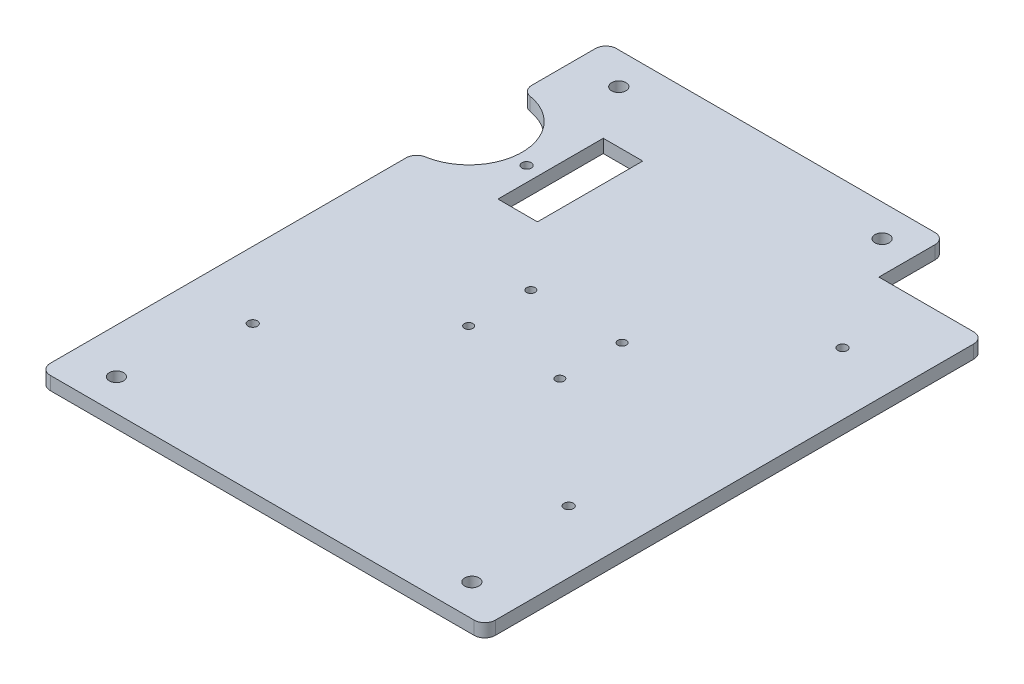
ISO-10303-21;
HEADER;
FILE_DESCRIPTION(('STEP AP214'),'2;1');
FILE_NAME('part.step','',(''),(''),'','','');
FILE_SCHEMA(('AUTOMOTIVE_DESIGN { 1 0 10303 214 1 1 1 1 }'));
ENDSEC;
DATA;
#1=APPLICATION_CONTEXT('core data for automotive mechanical design processes');
#2=APPLICATION_PROTOCOL_DEFINITION('international standard','automotive_design',2000,#1);
#3=PRODUCT_CONTEXT('',#1,'mechanical');
#4=PRODUCT('Part','Part','',(#3));
#5=PRODUCT_RELATED_PRODUCT_CATEGORY('part','',(#4));
#6=PRODUCT_DEFINITION_FORMATION('','',#4);
#7=PRODUCT_DEFINITION_CONTEXT('part definition',#1,'design');
#8=PRODUCT_DEFINITION('design','',#6,#7);
#9=PRODUCT_DEFINITION_SHAPE('','',#8);
#10=(LENGTH_UNIT() NAMED_UNIT(*) SI_UNIT(.MILLI.,.METRE.));
#11=(NAMED_UNIT(*) PLANE_ANGLE_UNIT() SI_UNIT($,.RADIAN.));
#12=(NAMED_UNIT(*) SI_UNIT($,.STERADIAN.) SOLID_ANGLE_UNIT());
#13=UNCERTAINTY_MEASURE_WITH_UNIT(LENGTH_MEASURE(1.E-05),#10,'distance_accuracy_value','');
#14=(GEOMETRIC_REPRESENTATION_CONTEXT(3) GLOBAL_UNCERTAINTY_ASSIGNED_CONTEXT((#13)) GLOBAL_UNIT_ASSIGNED_CONTEXT((#10,
#11,#12)) REPRESENTATION_CONTEXT('',''));
#15=CARTESIAN_POINT('',(0.,0.,0.));
#16=DIRECTION('',(0.,0.,1.));
#17=DIRECTION('',(1.,0.,0.));
#18=AXIS2_PLACEMENT_3D('',#15,#16,#17);
#19=CARTESIAN_POINT('',(0.,3.2004,-136.525));
#20=DIRECTION('',(1.,0.,0.));
#21=DIRECTION('',(0.,0.,-1.));
#22=AXIS2_PLACEMENT_3D('',#19,#20,#21);
#23=PLANE('',#22);
#24=DIRECTION('',(0.,0.,1.));
#25=VECTOR('',#24,1.);
#26=CARTESIAN_POINT('',(0.,3.2004,-136.525));
#27=LINE('',#26,#25);
#28=CARTESIAN_POINT('',(0.,3.2004,-133.985));
#29=VERTEX_POINT('',#28);
#30=CARTESIAN_POINT('',(0.,3.2004,-118.658971996708));
#31=VERTEX_POINT('',#30);
#32=EDGE_CURVE('E248',#29,#31,#27,.T.);
#33=ORIENTED_EDGE('',*,*,#32,.F.);
#34=DIRECTION('',(0.,-1.,0.));
#35=VECTOR('',#34,1.);
#36=CARTESIAN_POINT('',(0.,3.2004,-133.985));
#37=LINE('',#36,#35);
#38=CARTESIAN_POINT('',(0.,0.,-133.985));
#39=VERTEX_POINT('',#38);
#40=EDGE_CURVE('E316',#29,#39,#37,.T.);
#41=ORIENTED_EDGE('',*,*,#40,.T.);
#42=DIRECTION('',(0.,0.,1.));
#43=VECTOR('',#42,1.);
#44=CARTESIAN_POINT('',(0.,0.,-136.525));
#45=LINE('',#44,#43);
#46=CARTESIAN_POINT('',(0.,0.,-118.658971996708));
#47=VERTEX_POINT('',#46);
#48=EDGE_CURVE('E236',#39,#47,#45,.T.);
#49=ORIENTED_EDGE('',*,*,#48,.T.);
#50=DIRECTION('',(0.,1.,0.));
#51=VECTOR('',#50,1.);
#52=CARTESIAN_POINT('',(0.,3.2004,-118.658971996708));
#53=LINE('',#52,#51);
#54=EDGE_CURVE('E313',#47,#31,#53,.T.);
#55=ORIENTED_EDGE('',*,*,#54,.T.);
#56=EDGE_LOOP('',(#33,#41,#49,#55));
#57=FACE_BOUND('',#56,.T.);
#58=ADVANCED_FACE('F33',(#57),#23,.F.);
#59=CARTESIAN_POINT('',(0.,3.2004,0.));
#60=DIRECTION('',(0.,-1.,0.));
#61=DIRECTION('',(0.,0.,-1.));
#62=AXIS2_PLACEMENT_3D('',#59,#60,#61);
#63=PLANE('',#62);
#64=CARTESIAN_POINT('',(64.6575,3.2004,-60.7625));
#65=DIRECTION('',(0.,1.,0.));
#66=DIRECTION('',(0.,0.,1.));
#67=AXIS2_PLACEMENT_3D('',#64,#65,#66);
#68=CIRCLE('',#67,1.02489);
#69=CARTESIAN_POINT('',(64.6575,3.2004,-59.73761));
#70=VERTEX_POINT('',#69);
#71=EDGE_CURVE('E390',#70,#70,#68,.T.);
#72=ORIENTED_EDGE('',*,*,#71,.F.);
#73=EDGE_LOOP('',(#72));
#74=FACE_BOUND('',#73,.T.);
#75=CARTESIAN_POINT('',(42.6575,3.2004,-75.7625));
#76=DIRECTION('',(0.,1.,0.));
#77=DIRECTION('',(0.,0.,1.));
#78=AXIS2_PLACEMENT_3D('',#75,#76,#77);
#79=CIRCLE('',#78,1.02489);
#80=CARTESIAN_POINT('',(42.6575,3.2004,-74.73761));
#81=VERTEX_POINT('',#80);
#82=EDGE_CURVE('E391',#81,#81,#79,.T.);
#83=ORIENTED_EDGE('',*,*,#82,.F.);
#84=EDGE_LOOP('',(#83));
#85=FACE_BOUND('',#84,.T.);
#86=CARTESIAN_POINT('',(42.6575,3.2004,-60.7625));
#87=DIRECTION('',(0.,1.,0.));
#88=DIRECTION('',(0.,0.,1.));
#89=AXIS2_PLACEMENT_3D('',#86,#87,#88);
#90=CIRCLE('',#89,1.02489);
#91=CARTESIAN_POINT('',(42.6575,3.2004,-59.73761));
#92=VERTEX_POINT('',#91);
#93=EDGE_CURVE('E401',#92,#92,#90,.T.);
#94=ORIENTED_EDGE('',*,*,#93,.F.);
#95=EDGE_LOOP('',(#94));
#96=FACE_BOUND('',#95,.T.);
#97=CARTESIAN_POINT('',(64.6575,3.2004,-75.7625));
#98=DIRECTION('',(0.,1.,0.));
#99=DIRECTION('',(0.,0.,1.));
#100=AXIS2_PLACEMENT_3D('',#97,#98,#99);
#101=CIRCLE('',#100,1.02489);
#102=CARTESIAN_POINT('',(64.6575,3.2004,-74.73761));
#103=VERTEX_POINT('',#102);
#104=EDGE_CURVE('E383',#103,#103,#101,.T.);
#105=ORIENTED_EDGE('',*,*,#104,.F.);
#106=EDGE_LOOP('',(#105));
#107=FACE_BOUND('',#106,.T.);
#108=CARTESIAN_POINT('',(16.1128073912415,3.2004,-101.2825));
#109=DIRECTION('',(0.,1.,0.));
#110=DIRECTION('',(0.,0.,1.));
#111=AXIS2_PLACEMENT_3D('',#108,#109,#110);
#112=CIRCLE('',#111,1.13030000000001);
#113=CARTESIAN_POINT('',(16.1128073912415,3.2004,-100.1522));
#114=VERTEX_POINT('',#113);
#115=EDGE_CURVE('E370',#114,#114,#112,.T.);
#116=ORIENTED_EDGE('',*,*,#115,.F.);
#117=EDGE_LOOP('',(#116));
#118=FACE_BOUND('',#117,.T.);
#119=CARTESIAN_POINT('',(16.1128073912415,3.2004,-35.2425000000001));
#120=DIRECTION('',(0.,1.,0.));
#121=DIRECTION('',(0.,0.,1.));
#122=AXIS2_PLACEMENT_3D('',#119,#120,#121);
#123=CIRCLE('',#122,1.1303);
#124=CARTESIAN_POINT('',(16.1128073912415,3.2004,-34.1122000000001));
#125=VERTEX_POINT('',#124);
#126=EDGE_CURVE('E369',#125,#125,#123,.T.);
#127=ORIENTED_EDGE('',*,*,#126,.F.);
#128=EDGE_LOOP('',(#127));
#129=FACE_BOUND('',#128,.T.);
#130=CARTESIAN_POINT('',(92.3128073912416,3.2004,-35.2425000000001));
#131=DIRECTION('',(0.,1.,0.));
#132=DIRECTION('',(0.,0.,1.));
#133=AXIS2_PLACEMENT_3D('',#130,#131,#132);
#134=CIRCLE('',#133,1.1303);
#135=CARTESIAN_POINT('',(92.3128073912416,3.2004,-34.1122000000001));
#136=VERTEX_POINT('',#135);
#137=EDGE_CURVE('E363',#136,#136,#134,.T.);
#138=ORIENTED_EDGE('',*,*,#137,.F.);
#139=EDGE_LOOP('',(#138));
#140=FACE_BOUND('',#139,.T.);
#141=CARTESIAN_POINT('',(92.3128073912416,3.2004,-101.2825));
#142=DIRECTION('',(0.,1.,0.));
#143=DIRECTION('',(0.,0.,1.));
#144=AXIS2_PLACEMENT_3D('',#141,#142,#143);
#145=CIRCLE('',#144,1.1303);
#146=CARTESIAN_POINT('',(92.3128073912416,3.2004,-100.1522));
#147=VERTEX_POINT('',#146);
#148=EDGE_CURVE('E355',#147,#147,#145,.T.);
#149=ORIENTED_EDGE('',*,*,#148,.F.);
#150=EDGE_LOOP('',(#149));
#151=FACE_BOUND('',#150,.T.);
#152=DIRECTION('',(0.,0.,1.));
#153=VECTOR('',#152,1.);
#154=CARTESIAN_POINT('',(19.685,3.2004,-116.205));
#155=LINE('',#154,#153);
#156=CARTESIAN_POINT('',(19.685,3.2004,-116.205));
#157=VERTEX_POINT('',#156);
#158=CARTESIAN_POINT('',(19.685,3.2004,-90.805));
#159=VERTEX_POINT('',#158);
#160=EDGE_CURVE('E190',#157,#159,#155,.T.);
#161=ORIENTED_EDGE('',*,*,#160,.F.);
#162=DIRECTION('',(-1.,0.,0.));
#163=VECTOR('',#162,1.);
#164=CARTESIAN_POINT('',(29.21,3.2004,-116.205));
#165=LINE('',#164,#163);
#166=CARTESIAN_POINT('',(29.21,3.2004,-116.205));
#167=VERTEX_POINT('',#166);
#168=EDGE_CURVE('E182',#167,#157,#165,.T.);
#169=ORIENTED_EDGE('',*,*,#168,.F.);
#170=DIRECTION('',(0.,0.,-1.));
#171=VECTOR('',#170,1.);
#172=CARTESIAN_POINT('',(29.21,3.2004,-116.205));
#173=LINE('',#172,#171);
#174=CARTESIAN_POINT('',(29.21,3.2004,-90.805));
#175=VERTEX_POINT('',#174);
#176=EDGE_CURVE('E194',#175,#167,#173,.T.);
#177=ORIENTED_EDGE('',*,*,#176,.F.);
#178=DIRECTION('',(1.,0.,0.));
#179=VECTOR('',#178,1.);
#180=CARTESIAN_POINT('',(29.21,3.2004,-90.805));
#181=LINE('',#180,#179);
#182=EDGE_CURVE('E188',#159,#175,#181,.T.);
#183=ORIENTED_EDGE('',*,*,#182,.F.);
#184=EDGE_LOOP('',(#161,#169,#177,#183));
#185=FACE_BOUND('',#184,.T.);
#186=DIRECTION('',(1.,0.,0.));
#187=VECTOR('',#186,1.);
#188=CARTESIAN_POINT('',(0.,3.2004,0.));
#189=LINE('',#188,#187);
#190=CARTESIAN_POINT('',(2.54,3.2004,0.));
#191=VERTEX_POINT('',#190);
#192=CARTESIAN_POINT('',(104.775,3.2004,0.));
#193=VERTEX_POINT('',#192);
#194=EDGE_CURVE('E232',#191,#193,#189,.T.);
#195=ORIENTED_EDGE('',*,*,#194,.T.);
#196=CARTESIAN_POINT('',(104.775,3.2004,-2.54));
#197=DIRECTION('',(0.,-1.,0.));
#198=DIRECTION('',(0.,0.,-1.));
#199=AXIS2_PLACEMENT_3D('',#196,#197,#198);
#200=CIRCLE('',#199,2.54);
#201=CARTESIAN_POINT('',(107.315,3.2004,-2.54000000000003));
#202=VERTEX_POINT('',#201);
#203=EDGE_CURVE('E302',#193,#202,#200,.F.);
#204=ORIENTED_EDGE('',*,*,#203,.T.);
#205=DIRECTION('',(0.,0.,-1.));
#206=VECTOR('',#205,1.);
#207=CARTESIAN_POINT('',(107.315,3.2004,-120.4468));
#208=LINE('',#207,#206);
#209=CARTESIAN_POINT('',(107.315,3.2004,-117.9068));
#210=VERTEX_POINT('',#209);
#211=EDGE_CURVE('E235',#202,#210,#208,.T.);
#212=ORIENTED_EDGE('',*,*,#211,.T.);
#213=CARTESIAN_POINT('',(104.775,3.2004,-117.9068));
#214=DIRECTION('',(0.,-1.,0.));
#215=DIRECTION('',(0.,0.,-1.));
#216=AXIS2_PLACEMENT_3D('',#213,#214,#215);
#217=CIRCLE('',#216,2.54);
#218=CARTESIAN_POINT('',(104.775,3.2004,-120.4468));
#219=VERTEX_POINT('',#218);
#220=EDGE_CURVE('E300',#210,#219,#217,.F.);
#221=ORIENTED_EDGE('',*,*,#220,.T.);
#222=DIRECTION('',(-1.,0.,0.));
#223=VECTOR('',#222,1.);
#224=CARTESIAN_POINT('',(81.915,3.2004,-120.4468));
#225=LINE('',#224,#223);
#226=CARTESIAN_POINT('',(81.915,3.2004,-120.4468));
#227=VERTEX_POINT('',#226);
#228=EDGE_CURVE('E239',#219,#227,#225,.T.);
#229=ORIENTED_EDGE('',*,*,#228,.T.);
#230=DIRECTION('',(0.,0.,-1.));
#231=VECTOR('',#230,1.);
#232=CARTESIAN_POINT('',(81.9149999999999,3.2004,-136.525));
#233=LINE('',#232,#231);
#234=CARTESIAN_POINT('',(81.9149999999999,3.2004,-133.985));
#235=VERTEX_POINT('',#234);
#236=EDGE_CURVE('E241',#227,#235,#233,.T.);
#237=ORIENTED_EDGE('',*,*,#236,.T.);
#238=CARTESIAN_POINT('',(79.3749999999999,3.2004,-133.985));
#239=DIRECTION('',(0.,-1.,0.));
#240=DIRECTION('',(0.,0.,-1.));
#241=AXIS2_PLACEMENT_3D('',#238,#239,#240);
#242=CIRCLE('',#241,2.54);
#243=CARTESIAN_POINT('',(79.3749999999999,3.2004,-136.525));
#244=VERTEX_POINT('',#243);
#245=EDGE_CURVE('E55',#235,#244,#242,.F.);
#246=ORIENTED_EDGE('',*,*,#245,.T.);
#247=DIRECTION('',(-1.,0.,0.));
#248=VECTOR('',#247,1.);
#249=CARTESIAN_POINT('',(0.,3.2004,-136.525));
#250=LINE('',#249,#248);
#251=CARTESIAN_POINT('',(2.53999999999998,3.2004,-136.525));
#252=VERTEX_POINT('',#251);
#253=EDGE_CURVE('E243',#244,#252,#250,.T.);
#254=ORIENTED_EDGE('',*,*,#253,.T.);
#255=CARTESIAN_POINT('',(2.53999999999998,3.2004,-133.985));
#256=DIRECTION('',(0.,-1.,0.));
#257=DIRECTION('',(0.,0.,-1.));
#258=AXIS2_PLACEMENT_3D('',#255,#256,#257);
#259=CIRCLE('',#258,2.54);
#260=EDGE_CURVE('E297',#252,#29,#259,.F.);
#261=ORIENTED_EDGE('',*,*,#260,.T.);
#262=ORIENTED_EDGE('',*,*,#32,.T.);
#263=CARTESIAN_POINT('',(2.53999999999998,3.2004,-118.658971996708));
#264=DIRECTION('',(0.,-1.,0.));
#265=DIRECTION('',(0.,0.,-1.));
#266=AXIS2_PLACEMENT_3D('',#263,#264,#265);
#267=CIRCLE('',#266,2.54);
#268=CARTESIAN_POINT('',(2.12012063827044,3.2004,-116.153916843304));
#269=VERTEX_POINT('',#268);
#270=EDGE_CURVE('E295',#31,#269,#267,.F.);
#271=ORIENTED_EDGE('',*,*,#270,.T.);
#272=CARTESIAN_POINT('',(0.,3.2004,-103.505));
#273=DIRECTION('',(0.,1.,0.));
#274=DIRECTION('',(0.,0.,-1.));
#275=AXIS2_PLACEMENT_3D('',#272,#273,#274);
#276=CIRCLE('',#275,12.8253658360938);
#277=CARTESIAN_POINT('',(2.12012063827044,3.2004,-90.8560831566959));
#278=VERTEX_POINT('',#277);
#279=EDGE_CURVE('E205',#278,#269,#276,.T.);
#280=ORIENTED_EDGE('',*,*,#279,.F.);
#281=CARTESIAN_POINT('',(2.53999999999999,3.2004,-88.3510280032924));
#282=DIRECTION('',(0.,-1.,0.));
#283=DIRECTION('',(0.,0.,-1.));
#284=AXIS2_PLACEMENT_3D('',#281,#282,#283);
#285=CIRCLE('',#284,2.54);
#286=CARTESIAN_POINT('',(0.,3.2004,-88.3510280032924));
#287=VERTEX_POINT('',#286);
#288=EDGE_CURVE('E291',#278,#287,#285,.F.);
#289=ORIENTED_EDGE('',*,*,#288,.T.);
#290=CARTESIAN_POINT('',(0.,3.2004,-2.53999999999999));
#291=VERTEX_POINT('',#290);
#292=EDGE_CURVE('E245',#287,#291,#27,.T.);
#293=ORIENTED_EDGE('',*,*,#292,.T.);
#294=CARTESIAN_POINT('',(2.54,3.2004,-2.54));
#295=DIRECTION('',(0.,-1.,0.));
#296=DIRECTION('',(0.,0.,-1.));
#297=AXIS2_PLACEMENT_3D('',#294,#295,#296);
#298=CIRCLE('',#297,2.54);
#299=EDGE_CURVE('E293',#291,#191,#298,.F.);
#300=ORIENTED_EDGE('',*,*,#299,.T.);
#301=EDGE_LOOP('',(#195,#204,#212,#221,#229,#237,#246,#254,#261,#262,#271,#280,#289,#293,#300));
#302=FACE_BOUND('',#301,.T.);
#303=CARTESIAN_POINT('',(74.295,3.2004,-128.8415));
#304=DIRECTION('',(0.,1.,0.));
#305=DIRECTION('',(0.,0.,1.));
#306=AXIS2_PLACEMENT_3D('',#303,#304,#305);
#307=CIRCLE('',#306,1.7272);
#308=CARTESIAN_POINT('',(74.295,3.2004,-127.1143));
#309=VERTEX_POINT('',#308);
#310=EDGE_CURVE('E226',#309,#309,#307,.T.);
#311=ORIENTED_EDGE('',*,*,#310,.F.);
#312=EDGE_LOOP('',(#311));
#313=FACE_BOUND('',#312,.T.);
#314=CARTESIAN_POINT('',(10.795,3.2004,-128.8415));
#315=DIRECTION('',(0.,1.,0.));
#316=DIRECTION('',(0.,0.,1.));
#317=AXIS2_PLACEMENT_3D('',#314,#315,#316);
#318=CIRCLE('',#317,1.7272);
#319=CARTESIAN_POINT('',(10.795,3.2004,-127.1143));
#320=VERTEX_POINT('',#319);
#321=EDGE_CURVE('E220',#320,#320,#318,.T.);
#322=ORIENTED_EDGE('',*,*,#321,.F.);
#323=EDGE_LOOP('',(#322));
#324=FACE_BOUND('',#323,.T.);
#325=CARTESIAN_POINT('',(96.52,3.2004,-7.68349999999999));
#326=DIRECTION('',(0.,1.,0.));
#327=DIRECTION('',(0.,0.,1.));
#328=AXIS2_PLACEMENT_3D('',#325,#326,#327);
#329=CIRCLE('',#328,1.7272);
#330=CARTESIAN_POINT('',(96.52,3.2004,-5.95629999999999));
#331=VERTEX_POINT('',#330);
#332=EDGE_CURVE('E214',#331,#331,#329,.T.);
#333=ORIENTED_EDGE('',*,*,#332,.F.);
#334=EDGE_LOOP('',(#333));
#335=FACE_BOUND('',#334,.T.);
#336=CARTESIAN_POINT('',(10.795,3.2004,-7.68349999999998));
#337=DIRECTION('',(0.,1.,0.));
#338=DIRECTION('',(0.,0.,1.));
#339=AXIS2_PLACEMENT_3D('',#336,#337,#338);
#340=CIRCLE('',#339,1.7272);
#341=CARTESIAN_POINT('',(10.795,3.2004,-5.95629999999998));
#342=VERTEX_POINT('',#341);
#343=EDGE_CURVE('E206',#342,#342,#340,.T.);
#344=ORIENTED_EDGE('',*,*,#343,.F.);
#345=EDGE_LOOP('',(#344));
#346=FACE_BOUND('',#345,.T.);
#347=ADVANCED_FACE('F342',(#74,#85,#96,#107,#118,#129,#140,#151,#185,#302,#313,#324,#335,#346),
#63,.F.);
#348=CARTESIAN_POINT('',(0.,0.,0.));
#349=DIRECTION('',(0.,-1.,0.));
#350=DIRECTION('',(0.,0.,-1.));
#351=AXIS2_PLACEMENT_3D('',#348,#349,#350);
#352=PLANE('',#351);
#353=CARTESIAN_POINT('',(64.6575,0.,-60.7625));
#354=DIRECTION('',(0.,-1.,0.));
#355=DIRECTION('',(0.,0.,-1.));
#356=AXIS2_PLACEMENT_3D('',#353,#354,#355);
#357=CIRCLE('',#356,1.02489);
#358=CARTESIAN_POINT('',(64.6575,0.,-61.78739));
#359=VERTEX_POINT('',#358);
#360=EDGE_CURVE('E386',#359,#359,#357,.F.);
#361=ORIENTED_EDGE('',*,*,#360,.T.);
#362=EDGE_LOOP('',(#361));
#363=FACE_BOUND('',#362,.T.);
#364=CARTESIAN_POINT('',(42.6575,0.,-75.7625));
#365=DIRECTION('',(0.,-1.,0.));
#366=DIRECTION('',(0.,0.,-1.));
#367=AXIS2_PLACEMENT_3D('',#364,#365,#366);
#368=CIRCLE('',#367,1.02489);
#369=CARTESIAN_POINT('',(42.6575,0.,-76.78739));
#370=VERTEX_POINT('',#369);
#371=EDGE_CURVE('E387',#370,#370,#368,.F.);
#372=ORIENTED_EDGE('',*,*,#371,.T.);
#373=EDGE_LOOP('',(#372));
#374=FACE_BOUND('',#373,.T.);
#375=CARTESIAN_POINT('',(42.6575,0.,-60.7625));
#376=DIRECTION('',(0.,-1.,0.));
#377=DIRECTION('',(0.,0.,-1.));
#378=AXIS2_PLACEMENT_3D('',#375,#376,#377);
#379=CIRCLE('',#378,1.02489);
#380=CARTESIAN_POINT('',(42.6575,0.,-61.78739));
#381=VERTEX_POINT('',#380);
#382=EDGE_CURVE('E394',#381,#381,#379,.F.);
#383=ORIENTED_EDGE('',*,*,#382,.T.);
#384=EDGE_LOOP('',(#383));
#385=FACE_BOUND('',#384,.T.);
#386=CARTESIAN_POINT('',(64.6575,0.,-75.7625));
#387=DIRECTION('',(0.,-1.,0.));
#388=DIRECTION('',(0.,0.,-1.));
#389=AXIS2_PLACEMENT_3D('',#386,#387,#388);
#390=CIRCLE('',#389,1.02489);
#391=CARTESIAN_POINT('',(64.6575,0.,-76.78739));
#392=VERTEX_POINT('',#391);
#393=EDGE_CURVE('E373',#392,#392,#390,.F.);
#394=ORIENTED_EDGE('',*,*,#393,.T.);
#395=EDGE_LOOP('',(#394));
#396=FACE_BOUND('',#395,.T.);
#397=CARTESIAN_POINT('',(16.1128073912415,0.,-101.2825));
#398=DIRECTION('',(0.,-1.,0.));
#399=DIRECTION('',(0.,0.,-1.));
#400=AXIS2_PLACEMENT_3D('',#397,#398,#399);
#401=CIRCLE('',#400,1.13030000000001);
#402=CARTESIAN_POINT('',(16.1128073912415,0.,-102.4128));
#403=VERTEX_POINT('',#402);
#404=EDGE_CURVE('E366',#403,#403,#401,.F.);
#405=ORIENTED_EDGE('',*,*,#404,.T.);
#406=EDGE_LOOP('',(#405));
#407=FACE_BOUND('',#406,.T.);
#408=CARTESIAN_POINT('',(16.1128073912415,0.,-35.2425000000001));
#409=DIRECTION('',(0.,-1.,0.));
#410=DIRECTION('',(0.,0.,-1.));
#411=AXIS2_PLACEMENT_3D('',#408,#409,#410);
#412=CIRCLE('',#411,1.1303);
#413=CARTESIAN_POINT('',(16.1128073912415,0.,-36.3728000000001));
#414=VERTEX_POINT('',#413);
#415=EDGE_CURVE('E374',#414,#414,#412,.F.);
#416=ORIENTED_EDGE('',*,*,#415,.T.);
#417=EDGE_LOOP('',(#416));
#418=FACE_BOUND('',#417,.T.);
#419=CARTESIAN_POINT('',(92.3128073912416,0.,-35.2425000000001));
#420=DIRECTION('',(0.,-1.,0.));
#421=DIRECTION('',(0.,0.,-1.));
#422=AXIS2_PLACEMENT_3D('',#419,#420,#421);
#423=CIRCLE('',#422,1.1303);
#424=CARTESIAN_POINT('',(92.3128073912416,0.,-36.3728000000001));
#425=VERTEX_POINT('',#424);
#426=EDGE_CURVE('E359',#425,#425,#423,.F.);
#427=ORIENTED_EDGE('',*,*,#426,.T.);
#428=EDGE_LOOP('',(#427));
#429=FACE_BOUND('',#428,.T.);
#430=CARTESIAN_POINT('',(92.3128073912416,0.,-101.2825));
#431=DIRECTION('',(0.,-1.,0.));
#432=DIRECTION('',(0.,0.,-1.));
#433=AXIS2_PLACEMENT_3D('',#430,#431,#432);
#434=CIRCLE('',#433,1.1303);
#435=CARTESIAN_POINT('',(92.3128073912416,0.,-102.4128));
#436=VERTEX_POINT('',#435);
#437=EDGE_CURVE('E348',#436,#436,#434,.F.);
#438=ORIENTED_EDGE('',*,*,#437,.T.);
#439=EDGE_LOOP('',(#438));
#440=FACE_BOUND('',#439,.T.);
#441=DIRECTION('',(0.,0.,-1.));
#442=VECTOR('',#441,1.);
#443=CARTESIAN_POINT('',(107.315,0.,-120.4468));
#444=LINE('',#443,#442);
#445=CARTESIAN_POINT('',(107.315,0.,-2.54000000000003));
#446=VERTEX_POINT('',#445);
#447=CARTESIAN_POINT('',(107.315,0.,-117.9068));
#448=VERTEX_POINT('',#447);
#449=EDGE_CURVE('E251',#446,#448,#444,.T.);
#450=ORIENTED_EDGE('',*,*,#449,.F.);
#451=CARTESIAN_POINT('',(104.775,0.,-2.54));
#452=DIRECTION('',(0.,-1.,0.));
#453=DIRECTION('',(0.,0.,-1.));
#454=AXIS2_PLACEMENT_3D('',#451,#452,#453);
#455=CIRCLE('',#454,2.54);
#456=CARTESIAN_POINT('',(104.775,0.,0.));
#457=VERTEX_POINT('',#456);
#458=EDGE_CURVE('E284',#446,#457,#455,.T.);
#459=ORIENTED_EDGE('',*,*,#458,.T.);
#460=DIRECTION('',(1.,0.,0.));
#461=VECTOR('',#460,1.);
#462=CARTESIAN_POINT('',(0.,0.,0.));
#463=LINE('',#462,#461);
#464=CARTESIAN_POINT('',(2.54,0.,0.));
#465=VERTEX_POINT('',#464);
#466=EDGE_CURVE('E229',#465,#457,#463,.T.);
#467=ORIENTED_EDGE('',*,*,#466,.F.);
#468=CARTESIAN_POINT('',(2.54,0.,-2.54));
#469=DIRECTION('',(0.,-1.,0.));
#470=DIRECTION('',(0.,0.,-1.));
#471=AXIS2_PLACEMENT_3D('',#468,#469,#470);
#472=CIRCLE('',#471,2.54);
#473=CARTESIAN_POINT('',(0.,0.,-2.53999999999999));
#474=VERTEX_POINT('',#473);
#475=EDGE_CURVE('E274',#465,#474,#472,.T.);
#476=ORIENTED_EDGE('',*,*,#475,.T.);
#477=CARTESIAN_POINT('',(0.,0.,-88.3510280032924));
#478=VERTEX_POINT('',#477);
#479=EDGE_CURVE('E261',#478,#474,#45,.T.);
#480=ORIENTED_EDGE('',*,*,#479,.F.);
#481=CARTESIAN_POINT('',(2.53999999999999,0.,-88.3510280032924));
#482=DIRECTION('',(0.,-1.,0.));
#483=DIRECTION('',(0.,0.,-1.));
#484=AXIS2_PLACEMENT_3D('',#481,#482,#483);
#485=CIRCLE('',#484,2.54);
#486=CARTESIAN_POINT('',(2.12012063827044,0.,-90.8560831566959));
#487=VERTEX_POINT('',#486);
#488=EDGE_CURVE('E272',#478,#487,#485,.T.);
#489=ORIENTED_EDGE('',*,*,#488,.T.);
#490=CARTESIAN_POINT('',(0.,0.,-103.505));
#491=DIRECTION('',(0.,-1.,0.));
#492=DIRECTION('',(0.,0.,-1.));
#493=AXIS2_PLACEMENT_3D('',#490,#491,#492);
#494=CIRCLE('',#493,12.8253658360938);
#495=CARTESIAN_POINT('',(2.12012063827044,0.,-116.153916843304));
#496=VERTEX_POINT('',#495);
#497=EDGE_CURVE('E213',#487,#496,#494,.F.);
#498=ORIENTED_EDGE('',*,*,#497,.T.);
#499=CARTESIAN_POINT('',(2.53999999999998,0.,-118.658971996708));
#500=DIRECTION('',(0.,-1.,0.));
#501=DIRECTION('',(0.,0.,-1.));
#502=AXIS2_PLACEMENT_3D('',#499,#500,#501);
#503=CIRCLE('',#502,2.54);
#504=EDGE_CURVE('E276',#496,#47,#503,.T.);
#505=ORIENTED_EDGE('',*,*,#504,.T.);
#506=ORIENTED_EDGE('',*,*,#48,.F.);
#507=CARTESIAN_POINT('',(2.53999999999998,0.,-133.985));
#508=DIRECTION('',(0.,-1.,0.));
#509=DIRECTION('',(0.,0.,-1.));
#510=AXIS2_PLACEMENT_3D('',#507,#508,#509);
#511=CIRCLE('',#510,2.54);
#512=CARTESIAN_POINT('',(2.53999999999998,0.,-136.525));
#513=VERTEX_POINT('',#512);
#514=EDGE_CURVE('E278',#39,#513,#511,.T.);
#515=ORIENTED_EDGE('',*,*,#514,.T.);
#516=DIRECTION('',(-1.,0.,0.));
#517=VECTOR('',#516,1.);
#518=CARTESIAN_POINT('',(0.,0.,-136.525));
#519=LINE('',#518,#517);
#520=CARTESIAN_POINT('',(79.3749999999999,0.,-136.525));
#521=VERTEX_POINT('',#520);
#522=EDGE_CURVE('E259',#521,#513,#519,.T.);
#523=ORIENTED_EDGE('',*,*,#522,.F.);
#524=CARTESIAN_POINT('',(79.3749999999999,0.,-133.985));
#525=DIRECTION('',(0.,-1.,0.));
#526=DIRECTION('',(0.,0.,-1.));
#527=AXIS2_PLACEMENT_3D('',#524,#525,#526);
#528=CIRCLE('',#527,2.54);
#529=CARTESIAN_POINT('',(81.9149999999999,0.,-133.985));
#530=VERTEX_POINT('',#529);
#531=EDGE_CURVE('E280',#521,#530,#528,.T.);
#532=ORIENTED_EDGE('',*,*,#531,.T.);
#533=DIRECTION('',(0.,0.,-1.));
#534=VECTOR('',#533,1.);
#535=CARTESIAN_POINT('',(81.9149999999999,0.,-136.525));
#536=LINE('',#535,#534);
#537=CARTESIAN_POINT('',(81.915,0.,-120.4468));
#538=VERTEX_POINT('',#537);
#539=EDGE_CURVE('E256',#538,#530,#536,.T.);
#540=ORIENTED_EDGE('',*,*,#539,.F.);
#541=DIRECTION('',(-1.,0.,0.));
#542=VECTOR('',#541,1.);
#543=CARTESIAN_POINT('',(81.915,0.,-120.4468));
#544=LINE('',#543,#542);
#545=CARTESIAN_POINT('',(104.775,0.,-120.4468));
#546=VERTEX_POINT('',#545);
#547=EDGE_CURVE('E254',#546,#538,#544,.T.);
#548=ORIENTED_EDGE('',*,*,#547,.F.);
#549=CARTESIAN_POINT('',(104.775,0.,-117.9068));
#550=DIRECTION('',(0.,-1.,0.));
#551=DIRECTION('',(0.,0.,-1.));
#552=AXIS2_PLACEMENT_3D('',#549,#550,#551);
#553=CIRCLE('',#552,2.54);
#554=EDGE_CURVE('E282',#546,#448,#553,.T.);
#555=ORIENTED_EDGE('',*,*,#554,.T.);
#556=EDGE_LOOP('',(#450,#459,#467,#476,#480,#489,#498,#505,#506,#515,#523,#532,#540,#548,#555));
#557=FACE_BOUND('',#556,.T.);
#558=DIRECTION('',(-1.,0.,0.));
#559=VECTOR('',#558,1.);
#560=CARTESIAN_POINT('',(29.21,0.,-116.205));
#561=LINE('',#560,#559);
#562=CARTESIAN_POINT('',(29.21,0.,-116.205));
#563=VERTEX_POINT('',#562);
#564=CARTESIAN_POINT('',(19.685,0.,-116.205));
#565=VERTEX_POINT('',#564);
#566=EDGE_CURVE('E179',#563,#565,#561,.T.);
#567=ORIENTED_EDGE('',*,*,#566,.T.);
#568=DIRECTION('',(0.,0.,1.));
#569=VECTOR('',#568,1.);
#570=CARTESIAN_POINT('',(19.685,0.,-116.205));
#571=LINE('',#570,#569);
#572=CARTESIAN_POINT('',(19.685,0.,-90.805));
#573=VERTEX_POINT('',#572);
#574=EDGE_CURVE('E165',#565,#573,#571,.T.);
#575=ORIENTED_EDGE('',*,*,#574,.T.);
#576=DIRECTION('',(1.,0.,0.));
#577=VECTOR('',#576,1.);
#578=CARTESIAN_POINT('',(29.21,0.,-90.805));
#579=LINE('',#578,#577);
#580=CARTESIAN_POINT('',(29.21,0.,-90.805));
#581=VERTEX_POINT('',#580);
#582=EDGE_CURVE('E199',#573,#581,#579,.T.);
#583=ORIENTED_EDGE('',*,*,#582,.T.);
#584=DIRECTION('',(0.,0.,-1.));
#585=VECTOR('',#584,1.);
#586=CARTESIAN_POINT('',(29.21,0.,-116.205));
#587=LINE('',#586,#585);
#588=EDGE_CURVE('E187',#581,#563,#587,.T.);
#589=ORIENTED_EDGE('',*,*,#588,.T.);
#590=EDGE_LOOP('',(#567,#575,#583,#589));
#591=FACE_BOUND('',#590,.T.);
#592=CARTESIAN_POINT('',(96.52,0.,-7.68349999999999));
#593=DIRECTION('',(0.,1.,0.));
#594=DIRECTION('',(0.,0.,1.));
#595=AXIS2_PLACEMENT_3D('',#592,#593,#594);
#596=CIRCLE('',#595,1.7272);
#597=CARTESIAN_POINT('',(96.52,0.,-5.95629999999999));
#598=VERTEX_POINT('',#597);
#599=EDGE_CURVE('E209',#598,#598,#596,.T.);
#600=ORIENTED_EDGE('',*,*,#599,.T.);
#601=EDGE_LOOP('',(#600));
#602=FACE_BOUND('',#601,.T.);
#603=CARTESIAN_POINT('',(74.295,0.,-128.8415));
#604=DIRECTION('',(0.,1.,0.));
#605=DIRECTION('',(0.,0.,1.));
#606=AXIS2_PLACEMENT_3D('',#603,#604,#605);
#607=CIRCLE('',#606,1.7272);
#608=CARTESIAN_POINT('',(74.295,0.,-127.1143));
#609=VERTEX_POINT('',#608);
#610=EDGE_CURVE('E223',#609,#609,#607,.T.);
#611=ORIENTED_EDGE('',*,*,#610,.T.);
#612=EDGE_LOOP('',(#611));
#613=FACE_BOUND('',#612,.T.);
#614=CARTESIAN_POINT('',(10.795,0.,-128.8415));
#615=DIRECTION('',(0.,1.,0.));
#616=DIRECTION('',(0.,0.,1.));
#617=AXIS2_PLACEMENT_3D('',#614,#615,#616);
#618=CIRCLE('',#617,1.7272);
#619=CARTESIAN_POINT('',(10.795,0.,-127.1143));
#620=VERTEX_POINT('',#619);
#621=EDGE_CURVE('E217',#620,#620,#618,.T.);
#622=ORIENTED_EDGE('',*,*,#621,.T.);
#623=EDGE_LOOP('',(#622));
#624=FACE_BOUND('',#623,.T.);
#625=CARTESIAN_POINT('',(10.795,0.,-7.68349999999998));
#626=DIRECTION('',(0.,1.,0.));
#627=DIRECTION('',(0.,0.,1.));
#628=AXIS2_PLACEMENT_3D('',#625,#626,#627);
#629=CIRCLE('',#628,1.7272);
#630=CARTESIAN_POINT('',(10.795,0.,-5.95629999999998));
#631=VERTEX_POINT('',#630);
#632=EDGE_CURVE('E210',#631,#631,#629,.T.);
#633=ORIENTED_EDGE('',*,*,#632,.T.);
#634=EDGE_LOOP('',(#633));
#635=FACE_BOUND('',#634,.T.);
#636=ADVANCED_FACE('F185',(#363,#374,#385,#396,#407,#418,#429,#440,#557,#591,#602,#613,#624,
#635),#352,.T.);
#637=CARTESIAN_POINT('',(0.,3.2004,0.));
#638=DIRECTION('',(0.,0.,-1.));
#639=DIRECTION('',(-1.,0.,0.));
#640=AXIS2_PLACEMENT_3D('',#637,#638,#639);
#641=PLANE('',#640);
#642=ORIENTED_EDGE('',*,*,#466,.T.);
#643=DIRECTION('',(0.,-1.,0.));
#644=VECTOR('',#643,1.);
#645=CARTESIAN_POINT('',(104.775,3.2004,0.));
#646=LINE('',#645,#644);
#647=EDGE_CURVE('E289',#457,#193,#646,.F.);
#648=ORIENTED_EDGE('',*,*,#647,.T.);
#649=ORIENTED_EDGE('',*,*,#194,.F.);
#650=DIRECTION('',(0.,-1.,0.));
#651=VECTOR('',#650,1.);
#652=CARTESIAN_POINT('',(2.54,3.2004,0.));
#653=LINE('',#652,#651);
#654=EDGE_CURVE('E286',#191,#465,#653,.T.);
#655=ORIENTED_EDGE('',*,*,#654,.T.);
#656=EDGE_LOOP('',(#642,#648,#649,#655));
#657=FACE_BOUND('',#656,.T.);
#658=ADVANCED_FACE('F469',(#657),#641,.F.);
#659=CARTESIAN_POINT('',(107.315,3.2004,-120.4468));
#660=DIRECTION('',(-1.,0.,0.));
#661=DIRECTION('',(0.,0.,1.));
#662=AXIS2_PLACEMENT_3D('',#659,#660,#661);
#663=PLANE('',#662);
#664=ORIENTED_EDGE('',*,*,#211,.F.);
#665=DIRECTION('',(0.,-1.,0.));
#666=VECTOR('',#665,1.);
#667=CARTESIAN_POINT('',(107.315,3.2004,-2.54));
#668=LINE('',#667,#666);
#669=EDGE_CURVE('E269',#202,#446,#668,.T.);
#670=ORIENTED_EDGE('',*,*,#669,.T.);
#671=ORIENTED_EDGE('',*,*,#449,.T.);
#672=DIRECTION('',(0.,-1.,0.));
#673=VECTOR('',#672,1.);
#674=CARTESIAN_POINT('',(107.315,3.2004,-117.9068));
#675=LINE('',#674,#673);
#676=EDGE_CURVE('E267',#448,#210,#675,.F.);
#677=ORIENTED_EDGE('',*,*,#676,.T.);
#678=EDGE_LOOP('',(#664,#670,#671,#677));
#679=FACE_BOUND('',#678,.T.);
#680=ADVANCED_FACE('F465',(#679),#663,.F.);
#681=CARTESIAN_POINT('',(81.915,3.2004,-120.4468));
#682=DIRECTION('',(0.,0.,1.));
#683=DIRECTION('',(1.,0.,0.));
#684=AXIS2_PLACEMENT_3D('',#681,#682,#683);
#685=PLANE('',#684);
#686=ORIENTED_EDGE('',*,*,#228,.F.);
#687=DIRECTION('',(0.,-1.,0.));
#688=VECTOR('',#687,1.);
#689=CARTESIAN_POINT('',(104.775,3.2004,-120.4468));
#690=LINE('',#689,#688);
#691=EDGE_CURVE('E304',#219,#546,#690,.T.);
#692=ORIENTED_EDGE('',*,*,#691,.T.);
#693=ORIENTED_EDGE('',*,*,#547,.T.);
#694=DIRECTION('',(0.,-1.,0.));
#695=VECTOR('',#694,1.);
#696=CARTESIAN_POINT('',(81.915,3.2004,-120.4468));
#697=LINE('',#696,#695);
#698=EDGE_CURVE('E264',#227,#538,#697,.T.);
#699=ORIENTED_EDGE('',*,*,#698,.F.);
#700=EDGE_LOOP('',(#686,#692,#693,#699));
#701=FACE_BOUND('',#700,.T.);
#702=ADVANCED_FACE('F459',(#701),#685,.F.);
#703=CARTESIAN_POINT('',(81.9149999999999,3.2004,-136.525));
#704=DIRECTION('',(-1.,0.,0.));
#705=DIRECTION('',(0.,0.,1.));
#706=AXIS2_PLACEMENT_3D('',#703,#704,#705);
#707=PLANE('',#706);
#708=ORIENTED_EDGE('',*,*,#539,.T.);
#709=DIRECTION('',(0.,-1.,0.));
#710=VECTOR('',#709,1.);
#711=CARTESIAN_POINT('',(81.9149999999999,3.2004,-133.985));
#712=LINE('',#711,#710);
#713=EDGE_CURVE('E311',#530,#235,#712,.F.);
#714=ORIENTED_EDGE('',*,*,#713,.T.);
#715=ORIENTED_EDGE('',*,*,#236,.F.);
#716=ORIENTED_EDGE('',*,*,#698,.T.);
#717=EDGE_LOOP('',(#708,#714,#715,#716));
#718=FACE_BOUND('',#717,.T.);
#719=ADVANCED_FACE('F455',(#718),#707,.F.);
#720=CARTESIAN_POINT('',(0.,3.2004,-136.525));
#721=DIRECTION('',(0.,0.,1.));
#722=DIRECTION('',(1.,0.,0.));
#723=AXIS2_PLACEMENT_3D('',#720,#721,#722);
#724=PLANE('',#723);
#725=ORIENTED_EDGE('',*,*,#253,.F.);
#726=DIRECTION('',(0.,-1.,0.));
#727=VECTOR('',#726,1.);
#728=CARTESIAN_POINT('',(79.3749999999999,3.2004,-136.525));
#729=LINE('',#728,#727);
#730=EDGE_CURVE('E308',#244,#521,#729,.T.);
#731=ORIENTED_EDGE('',*,*,#730,.T.);
#732=ORIENTED_EDGE('',*,*,#522,.T.);
#733=DIRECTION('',(0.,-1.,0.));
#734=VECTOR('',#733,1.);
#735=CARTESIAN_POINT('',(2.53999999999998,3.2004,-136.525));
#736=LINE('',#735,#734);
#737=EDGE_CURVE('E48',#513,#252,#736,.F.);
#738=ORIENTED_EDGE('',*,*,#737,.T.);
#739=EDGE_LOOP('',(#725,#731,#732,#738));
#740=FACE_BOUND('',#739,.T.);
#741=ADVANCED_FACE('F447',(#740),#724,.F.);
#742=ORIENTED_EDGE('',*,*,#479,.T.);
#743=DIRECTION('',(0.,-1.,0.));
#744=VECTOR('',#743,1.);
#745=CARTESIAN_POINT('',(0.,3.2004,-2.53999999999999));
#746=LINE('',#745,#744);
#747=EDGE_CURVE('E11',#474,#291,#746,.F.);
#748=ORIENTED_EDGE('',*,*,#747,.T.);
#749=ORIENTED_EDGE('',*,*,#292,.F.);
#750=DIRECTION('',(0.,1.,0.));
#751=VECTOR('',#750,1.);
#752=CARTESIAN_POINT('',(0.,3.2004,-88.3510280032924));
#753=LINE('',#752,#751);
#754=EDGE_CURVE('E41',#287,#478,#753,.F.);
#755=ORIENTED_EDGE('',*,*,#754,.T.);
#756=EDGE_LOOP('',(#742,#748,#749,#755));
#757=FACE_BOUND('',#756,.T.);
#758=ADVANCED_FACE('F327',(#757),#23,.F.);
#759=CARTESIAN_POINT('',(74.295,3.2004,-128.8415));
#760=DIRECTION('',(0.,-1.,0.));
#761=DIRECTION('',(0.,0.,-1.));
#762=AXIS2_PLACEMENT_3D('',#759,#760,#761);
#763=CYLINDRICAL_SURFACE('',#762,1.7272);
#764=ORIENTED_EDGE('',*,*,#310,.T.);
#765=EDGE_LOOP('',(#764));
#766=FACE_BOUND('',#765,.T.);
#767=ORIENTED_EDGE('',*,*,#610,.F.);
#768=EDGE_LOOP('',(#767));
#769=FACE_BOUND('',#768,.T.);
#770=ADVANCED_FACE('F446',(#766,#769),#763,.F.);
#771=CARTESIAN_POINT('',(10.795,3.2004,-128.8415));
#772=DIRECTION('',(0.,-1.,0.));
#773=DIRECTION('',(0.,0.,-1.));
#774=AXIS2_PLACEMENT_3D('',#771,#772,#773);
#775=CYLINDRICAL_SURFACE('',#774,1.7272);
#776=ORIENTED_EDGE('',*,*,#321,.T.);
#777=EDGE_LOOP('',(#776));
#778=FACE_BOUND('',#777,.T.);
#779=ORIENTED_EDGE('',*,*,#621,.F.);
#780=EDGE_LOOP('',(#779));
#781=FACE_BOUND('',#780,.T.);
#782=ADVANCED_FACE('F452',(#778,#781),#775,.F.);
#783=CARTESIAN_POINT('',(96.52,3.2004,-7.68349999999999));
#784=DIRECTION('',(0.,-1.,0.));
#785=DIRECTION('',(0.,0.,-1.));
#786=AXIS2_PLACEMENT_3D('',#783,#784,#785);
#787=CYLINDRICAL_SURFACE('',#786,1.7272);
#788=ORIENTED_EDGE('',*,*,#332,.T.);
#789=EDGE_LOOP('',(#788));
#790=FACE_BOUND('',#789,.T.);
#791=ORIENTED_EDGE('',*,*,#599,.F.);
#792=EDGE_LOOP('',(#791));
#793=FACE_BOUND('',#792,.T.);
#794=ADVANCED_FACE('F555',(#790,#793),#787,.F.);
#795=CARTESIAN_POINT('',(10.795,3.2004,-7.68349999999998));
#796=DIRECTION('',(0.,-1.,0.));
#797=DIRECTION('',(0.,0.,-1.));
#798=AXIS2_PLACEMENT_3D('',#795,#796,#797);
#799=CYLINDRICAL_SURFACE('',#798,1.7272);
#800=ORIENTED_EDGE('',*,*,#343,.T.);
#801=EDGE_LOOP('',(#800));
#802=FACE_BOUND('',#801,.T.);
#803=ORIENTED_EDGE('',*,*,#632,.F.);
#804=EDGE_LOOP('',(#803));
#805=FACE_BOUND('',#804,.T.);
#806=ADVANCED_FACE('F549',(#802,#805),#799,.F.);
#807=CARTESIAN_POINT('',(0.,-28.6783898458091,-103.505));
#808=DIRECTION('',(0.,1.,0.));
#809=DIRECTION('',(0.,0.,1.));
#810=AXIS2_PLACEMENT_3D('',#807,#808,#809);
#811=CYLINDRICAL_SURFACE('',#810,12.8253658360938);
#812=ORIENTED_EDGE('',*,*,#279,.T.);
#813=DIRECTION('',(0.,1.,0.));
#814=VECTOR('',#813,1.);
#815=CARTESIAN_POINT('',(2.12012063827044,-28.6783898458091,-116.153916843304));
#816=LINE('',#815,#814);
#817=EDGE_CURVE('E322',#269,#496,#816,.F.);
#818=ORIENTED_EDGE('',*,*,#817,.T.);
#819=ORIENTED_EDGE('',*,*,#497,.F.);
#820=DIRECTION('',(0.,1.,0.));
#821=VECTOR('',#820,1.);
#822=CARTESIAN_POINT('',(2.12012063827044,-28.6783898458091,-90.8560831566959));
#823=LINE('',#822,#821);
#824=EDGE_CURVE('E319',#487,#278,#823,.T.);
#825=ORIENTED_EDGE('',*,*,#824,.T.);
#826=EDGE_LOOP('',(#812,#818,#819,#825));
#827=FACE_BOUND('',#826,.T.);
#828=ADVANCED_FACE('F340',(#827),#811,.F.);
#829=CARTESIAN_POINT('',(29.21,-28.6783898458091,-116.205));
#830=DIRECTION('',(0.,0.,-1.));
#831=DIRECTION('',(-1.,0.,0.));
#832=AXIS2_PLACEMENT_3D('',#829,#830,#831);
#833=PLANE('',#832);
#834=DIRECTION('',(0.,1.,0.));
#835=VECTOR('',#834,1.);
#836=CARTESIAN_POINT('',(29.21,-28.6783898458091,-116.205));
#837=LINE('',#836,#835);
#838=EDGE_CURVE('E197',#563,#167,#837,.T.);
#839=ORIENTED_EDGE('',*,*,#838,.T.);
#840=ORIENTED_EDGE('',*,*,#168,.T.);
#841=DIRECTION('',(0.,1.,0.));
#842=VECTOR('',#841,1.);
#843=CARTESIAN_POINT('',(19.685,-28.6783898458091,-116.205));
#844=LINE('',#843,#842);
#845=EDGE_CURVE('E169',#565,#157,#844,.T.);
#846=ORIENTED_EDGE('',*,*,#845,.F.);
#847=ORIENTED_EDGE('',*,*,#566,.F.);
#848=EDGE_LOOP('',(#839,#840,#846,#847));
#849=FACE_BOUND('',#848,.T.);
#850=ADVANCED_FACE('F178',(#849),#833,.F.);
#851=CARTESIAN_POINT('',(19.685,-28.6783898458091,-116.205));
#852=DIRECTION('',(-1.,0.,0.));
#853=DIRECTION('',(0.,0.,1.));
#854=AXIS2_PLACEMENT_3D('',#851,#852,#853);
#855=PLANE('',#854);
#856=ORIENTED_EDGE('',*,*,#845,.T.);
#857=ORIENTED_EDGE('',*,*,#160,.T.);
#858=DIRECTION('',(0.,1.,0.));
#859=VECTOR('',#858,1.);
#860=CARTESIAN_POINT('',(19.685,-28.6783898458091,-90.805));
#861=LINE('',#860,#859);
#862=EDGE_CURVE('E171',#573,#159,#861,.T.);
#863=ORIENTED_EDGE('',*,*,#862,.F.);
#864=ORIENTED_EDGE('',*,*,#574,.F.);
#865=EDGE_LOOP('',(#856,#857,#863,#864));
#866=FACE_BOUND('',#865,.T.);
#867=ADVANCED_FACE('F167',(#866),#855,.F.);
#868=CARTESIAN_POINT('',(29.21,-28.6783898458091,-90.805));
#869=DIRECTION('',(0.,0.,1.));
#870=DIRECTION('',(1.,0.,0.));
#871=AXIS2_PLACEMENT_3D('',#868,#869,#870);
#872=PLANE('',#871);
#873=ORIENTED_EDGE('',*,*,#862,.T.);
#874=ORIENTED_EDGE('',*,*,#182,.T.);
#875=DIRECTION('',(0.,1.,0.));
#876=VECTOR('',#875,1.);
#877=CARTESIAN_POINT('',(29.21,-28.6783898458091,-90.805));
#878=LINE('',#877,#876);
#879=EDGE_CURVE('E198',#581,#175,#878,.T.);
#880=ORIENTED_EDGE('',*,*,#879,.F.);
#881=ORIENTED_EDGE('',*,*,#582,.F.);
#882=EDGE_LOOP('',(#873,#874,#880,#881));
#883=FACE_BOUND('',#882,.T.);
#884=ADVANCED_FACE('F424',(#883),#872,.F.);
#885=CARTESIAN_POINT('',(29.21,-28.6783898458091,-116.205));
#886=DIRECTION('',(1.,0.,0.));
#887=DIRECTION('',(0.,0.,-1.));
#888=AXIS2_PLACEMENT_3D('',#885,#886,#887);
#889=PLANE('',#888);
#890=ORIENTED_EDGE('',*,*,#879,.T.);
#891=ORIENTED_EDGE('',*,*,#176,.T.);
#892=ORIENTED_EDGE('',*,*,#838,.F.);
#893=ORIENTED_EDGE('',*,*,#588,.F.);
#894=EDGE_LOOP('',(#890,#891,#892,#893));
#895=FACE_BOUND('',#894,.T.);
#896=ADVANCED_FACE('F425',(#895),#889,.F.);
#897=CARTESIAN_POINT('',(92.3128073912416,-3.19697117910066,-101.2825));
#898=DIRECTION('',(0.,1.,0.));
#899=DIRECTION('',(0.,0.,1.));
#900=AXIS2_PLACEMENT_3D('',#897,#898,#899);
#901=CYLINDRICAL_SURFACE('',#900,1.1303);
#902=ORIENTED_EDGE('',*,*,#148,.T.);
#903=EDGE_LOOP('',(#902));
#904=FACE_BOUND('',#903,.T.);
#905=ORIENTED_EDGE('',*,*,#437,.F.);
#906=EDGE_LOOP('',(#905));
#907=FACE_BOUND('',#906,.T.);
#908=ADVANCED_FACE('F427',(#904,#907),#901,.F.);
#909=CARTESIAN_POINT('',(92.3128073912416,-3.19697117910066,-35.2425000000001));
#910=DIRECTION('',(0.,1.,0.));
#911=DIRECTION('',(0.,0.,1.));
#912=AXIS2_PLACEMENT_3D('',#909,#910,#911);
#913=CYLINDRICAL_SURFACE('',#912,1.1303);
#914=ORIENTED_EDGE('',*,*,#137,.T.);
#915=EDGE_LOOP('',(#914));
#916=FACE_BOUND('',#915,.T.);
#917=ORIENTED_EDGE('',*,*,#426,.F.);
#918=EDGE_LOOP('',(#917));
#919=FACE_BOUND('',#918,.T.);
#920=ADVANCED_FACE('F433',(#916,#919),#913,.F.);
#921=CARTESIAN_POINT('',(16.1128073912415,-3.19697117910066,-35.2425000000001));
#922=DIRECTION('',(0.,1.,0.));
#923=DIRECTION('',(0.,0.,1.));
#924=AXIS2_PLACEMENT_3D('',#921,#922,#923);
#925=CYLINDRICAL_SURFACE('',#924,1.1303);
#926=ORIENTED_EDGE('',*,*,#126,.T.);
#927=EDGE_LOOP('',(#926));
#928=FACE_BOUND('',#927,.T.);
#929=ORIENTED_EDGE('',*,*,#415,.F.);
#930=EDGE_LOOP('',(#929));
#931=FACE_BOUND('',#930,.T.);
#932=ADVANCED_FACE('F541',(#928,#931),#925,.F.);
#933=CARTESIAN_POINT('',(16.1128073912415,-3.19697117910066,-101.2825));
#934=DIRECTION('',(0.,1.,0.));
#935=DIRECTION('',(0.,0.,1.));
#936=AXIS2_PLACEMENT_3D('',#933,#934,#935);
#937=CYLINDRICAL_SURFACE('',#936,1.13030000000001);
#938=ORIENTED_EDGE('',*,*,#115,.T.);
#939=EDGE_LOOP('',(#938));
#940=FACE_BOUND('',#939,.T.);
#941=ORIENTED_EDGE('',*,*,#404,.F.);
#942=EDGE_LOOP('',(#941));
#943=FACE_BOUND('',#942,.T.);
#944=ADVANCED_FACE('F478',(#940,#943),#937,.F.);
#945=CARTESIAN_POINT('',(104.775,3.2004,-2.54));
#946=DIRECTION('',(0.,-1.,0.));
#947=DIRECTION('',(0.,0.,-1.));
#948=AXIS2_PLACEMENT_3D('',#945,#946,#947);
#949=CYLINDRICAL_SURFACE('',#948,2.54);
#950=ORIENTED_EDGE('',*,*,#203,.F.);
#951=ORIENTED_EDGE('',*,*,#647,.F.);
#952=ORIENTED_EDGE('',*,*,#458,.F.);
#953=ORIENTED_EDGE('',*,*,#669,.F.);
#954=EDGE_LOOP('',(#950,#951,#952,#953));
#955=FACE_BOUND('',#954,.T.);
#956=ADVANCED_FACE('F474',(#955),#949,.T.);
#957=CARTESIAN_POINT('',(104.775,3.2004,-117.9068));
#958=DIRECTION('',(0.,-1.,0.));
#959=DIRECTION('',(0.,0.,-1.));
#960=AXIS2_PLACEMENT_3D('',#957,#958,#959);
#961=CYLINDRICAL_SURFACE('',#960,2.54);
#962=ORIENTED_EDGE('',*,*,#220,.F.);
#963=ORIENTED_EDGE('',*,*,#676,.F.);
#964=ORIENTED_EDGE('',*,*,#554,.F.);
#965=ORIENTED_EDGE('',*,*,#691,.F.);
#966=EDGE_LOOP('',(#962,#963,#964,#965));
#967=FACE_BOUND('',#966,.T.);
#968=ADVANCED_FACE('F477',(#967),#961,.T.);
#969=CARTESIAN_POINT('',(79.3749999999999,3.2004,-133.985));
#970=DIRECTION('',(0.,-1.,0.));
#971=DIRECTION('',(0.,0.,-1.));
#972=AXIS2_PLACEMENT_3D('',#969,#970,#971);
#973=CYLINDRICAL_SURFACE('',#972,2.54);
#974=ORIENTED_EDGE('',*,*,#245,.F.);
#975=ORIENTED_EDGE('',*,*,#713,.F.);
#976=ORIENTED_EDGE('',*,*,#531,.F.);
#977=ORIENTED_EDGE('',*,*,#730,.F.);
#978=EDGE_LOOP('',(#974,#975,#976,#977));
#979=FACE_BOUND('',#978,.T.);
#980=ADVANCED_FACE('F482',(#979),#973,.T.);
#981=CARTESIAN_POINT('',(2.53999999999998,3.2004,-133.985));
#982=DIRECTION('',(0.,-1.,0.));
#983=DIRECTION('',(0.,0.,-1.));
#984=AXIS2_PLACEMENT_3D('',#981,#982,#983);
#985=CYLINDRICAL_SURFACE('',#984,2.54);
#986=ORIENTED_EDGE('',*,*,#260,.F.);
#987=ORIENTED_EDGE('',*,*,#737,.F.);
#988=ORIENTED_EDGE('',*,*,#514,.F.);
#989=ORIENTED_EDGE('',*,*,#40,.F.);
#990=EDGE_LOOP('',(#986,#987,#988,#989));
#991=FACE_BOUND('',#990,.T.);
#992=ADVANCED_FACE('F486',(#991),#985,.T.);
#993=CARTESIAN_POINT('',(2.53999999999998,-28.6783898458091,-118.658971996708));
#994=DIRECTION('',(0.,1.,0.));
#995=DIRECTION('',(0.,0.,1.));
#996=AXIS2_PLACEMENT_3D('',#993,#994,#995);
#997=CYLINDRICAL_SURFACE('',#996,2.54);
#998=ORIENTED_EDGE('',*,*,#504,.F.);
#999=ORIENTED_EDGE('',*,*,#817,.F.);
#1000=ORIENTED_EDGE('',*,*,#270,.F.);
#1001=ORIENTED_EDGE('',*,*,#54,.F.);
#1002=EDGE_LOOP('',(#998,#999,#1000,#1001));
#1003=FACE_BOUND('',#1002,.T.);
#1004=ADVANCED_FACE('F490',(#1003),#997,.T.);
#1005=CARTESIAN_POINT('',(2.54,3.2004,-2.54));
#1006=DIRECTION('',(0.,-1.,0.));
#1007=DIRECTION('',(0.,0.,-1.));
#1008=AXIS2_PLACEMENT_3D('',#1005,#1006,#1007);
#1009=CYLINDRICAL_SURFACE('',#1008,2.54);
#1010=ORIENTED_EDGE('',*,*,#299,.F.);
#1011=ORIENTED_EDGE('',*,*,#747,.F.);
#1012=ORIENTED_EDGE('',*,*,#475,.F.);
#1013=ORIENTED_EDGE('',*,*,#654,.F.);
#1014=EDGE_LOOP('',(#1010,#1011,#1012,#1013));
#1015=FACE_BOUND('',#1014,.T.);
#1016=ADVANCED_FACE('F493',(#1015),#1009,.T.);
#1017=CARTESIAN_POINT('',(2.53999999999999,-28.6783898458091,-88.3510280032924));
#1018=DIRECTION('',(0.,1.,0.));
#1019=DIRECTION('',(0.,0.,1.));
#1020=AXIS2_PLACEMENT_3D('',#1017,#1018,#1019);
#1021=CYLINDRICAL_SURFACE('',#1020,2.54);
#1022=ORIENTED_EDGE('',*,*,#488,.F.);
#1023=ORIENTED_EDGE('',*,*,#754,.F.);
#1024=ORIENTED_EDGE('',*,*,#288,.F.);
#1025=ORIENTED_EDGE('',*,*,#824,.F.);
#1026=EDGE_LOOP('',(#1022,#1023,#1024,#1025));
#1027=FACE_BOUND('',#1026,.T.);
#1028=ADVANCED_FACE('F35',(#1027),#1021,.T.);
#1029=CARTESIAN_POINT('',(64.6575,-2.89882667588112,-75.7625));
#1030=DIRECTION('',(0.,1.,0.));
#1031=DIRECTION('',(0.,0.,1.));
#1032=AXIS2_PLACEMENT_3D('',#1029,#1030,#1031);
#1033=CYLINDRICAL_SURFACE('',#1032,1.02489);
#1034=ORIENTED_EDGE('',*,*,#104,.T.);
#1035=EDGE_LOOP('',(#1034));
#1036=FACE_BOUND('',#1035,.T.);
#1037=ORIENTED_EDGE('',*,*,#393,.F.);
#1038=EDGE_LOOP('',(#1037));
#1039=FACE_BOUND('',#1038,.T.);
#1040=ADVANCED_FACE('F500',(#1036,#1039),#1033,.F.);
#1041=CARTESIAN_POINT('',(42.6575,-2.89882667588112,-60.7625));
#1042=DIRECTION('',(0.,1.,0.));
#1043=DIRECTION('',(0.,0.,1.));
#1044=AXIS2_PLACEMENT_3D('',#1041,#1042,#1043);
#1045=CYLINDRICAL_SURFACE('',#1044,1.02489);
#1046=ORIENTED_EDGE('',*,*,#93,.T.);
#1047=EDGE_LOOP('',(#1046));
#1048=FACE_BOUND('',#1047,.T.);
#1049=ORIENTED_EDGE('',*,*,#382,.F.);
#1050=EDGE_LOOP('',(#1049));
#1051=FACE_BOUND('',#1050,.T.);
#1052=ADVANCED_FACE('F405',(#1048,#1051),#1045,.F.);
#1053=CARTESIAN_POINT('',(42.6575,-2.89882667588112,-75.7625));
#1054=DIRECTION('',(0.,1.,0.));
#1055=DIRECTION('',(0.,0.,1.));
#1056=AXIS2_PLACEMENT_3D('',#1053,#1054,#1055);
#1057=CYLINDRICAL_SURFACE('',#1056,1.02489);
#1058=ORIENTED_EDGE('',*,*,#82,.T.);
#1059=EDGE_LOOP('',(#1058));
#1060=FACE_BOUND('',#1059,.T.);
#1061=ORIENTED_EDGE('',*,*,#371,.F.);
#1062=EDGE_LOOP('',(#1061));
#1063=FACE_BOUND('',#1062,.T.);
#1064=ADVANCED_FACE('F533',(#1060,#1063),#1057,.F.);
#1065=CARTESIAN_POINT('',(64.6575,-2.89882667588112,-60.7625));
#1066=DIRECTION('',(0.,1.,0.));
#1067=DIRECTION('',(0.,0.,1.));
#1068=AXIS2_PLACEMENT_3D('',#1065,#1066,#1067);
#1069=CYLINDRICAL_SURFACE('',#1068,1.02489);
#1070=ORIENTED_EDGE('',*,*,#71,.T.);
#1071=EDGE_LOOP('',(#1070));
#1072=FACE_BOUND('',#1071,.T.);
#1073=ORIENTED_EDGE('',*,*,#360,.F.);
#1074=EDGE_LOOP('',(#1073));
#1075=FACE_BOUND('',#1074,.T.);
#1076=ADVANCED_FACE('F590',(#1072,#1075),#1069,.F.);
#1077=CLOSED_SHELL('',(#58,#347,#636,#658,#680,#702,#719,#741,#758,#770,#782,#794,#806,#828,
#850,#867,#884,#896,#908,#920,#932,#944,#956,#968,#980,#992,#1004,#1016,#1028,#1040,#1052,#1064,#1076));
#1078=MANIFOLD_SOLID_BREP('B2',#1077);
#1079=ADVANCED_BREP_SHAPE_REPRESENTATION('',(#18,#1078),#14);
#1080=SHAPE_DEFINITION_REPRESENTATION(#9,#1079);
ENDSEC;
END-ISO-10303-21;
